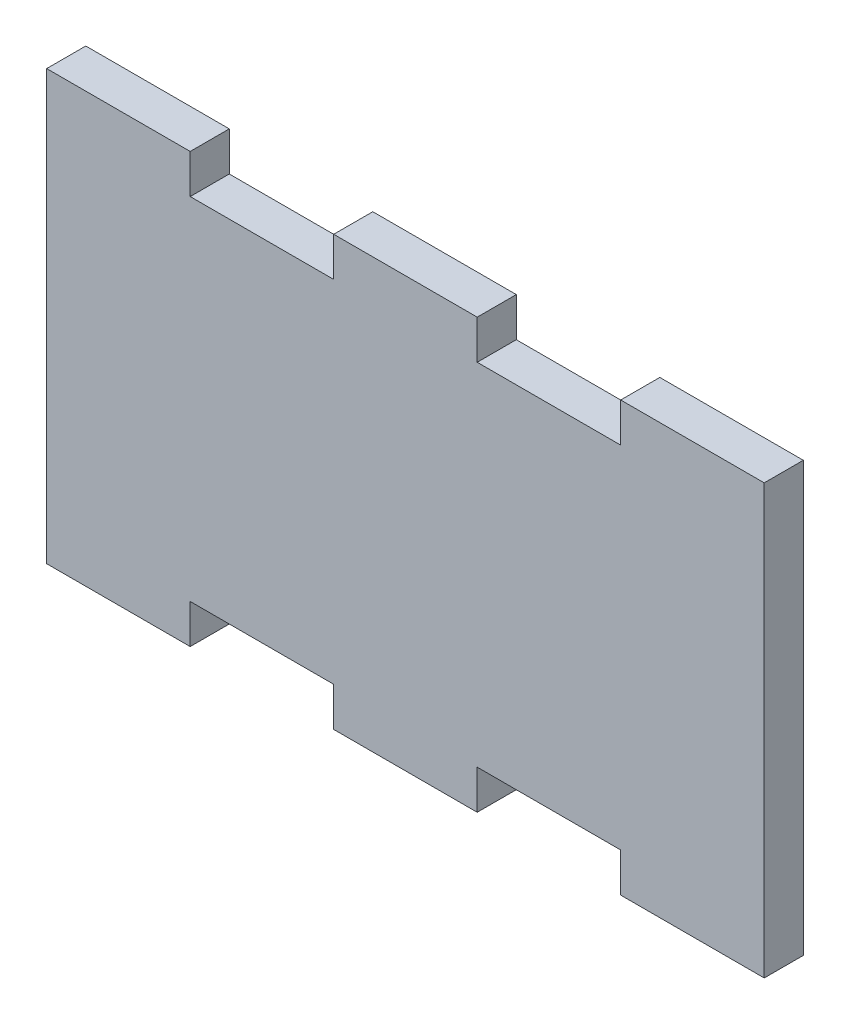
ISO-10303-21;
HEADER;
FILE_DESCRIPTION(('STEP AP214'),'2;1');
FILE_NAME('part.step','',(''),(''),'','','');
FILE_SCHEMA(('AUTOMOTIVE_DESIGN { 1 0 10303 214 1 1 1 1 }'));
ENDSEC;
DATA;
#1=APPLICATION_CONTEXT('core data for automotive mechanical design processes');
#2=APPLICATION_PROTOCOL_DEFINITION('international standard','automotive_design',2000,#1);
#3=PRODUCT_CONTEXT('',#1,'mechanical');
#4=PRODUCT('Part','Part','',(#3));
#5=PRODUCT_RELATED_PRODUCT_CATEGORY('part','',(#4));
#6=PRODUCT_DEFINITION_FORMATION('','',#4);
#7=PRODUCT_DEFINITION_CONTEXT('part definition',#1,'design');
#8=PRODUCT_DEFINITION('design','',#6,#7);
#9=PRODUCT_DEFINITION_SHAPE('','',#8);
#10=(LENGTH_UNIT() NAMED_UNIT(*) SI_UNIT(.MILLI.,.METRE.));
#11=(NAMED_UNIT(*) PLANE_ANGLE_UNIT() SI_UNIT($,.RADIAN.));
#12=(NAMED_UNIT(*) SI_UNIT($,.STERADIAN.) SOLID_ANGLE_UNIT());
#13=UNCERTAINTY_MEASURE_WITH_UNIT(LENGTH_MEASURE(1.E-05),#10,'distance_accuracy_value','');
#14=(GEOMETRIC_REPRESENTATION_CONTEXT(3) GLOBAL_UNCERTAINTY_ASSIGNED_CONTEXT((#13)) GLOBAL_UNIT_ASSIGNED_CONTEXT((#10,
#11,#12)) REPRESENTATION_CONTEXT('',''));
#15=CARTESIAN_POINT('',(0.,0.,0.));
#16=DIRECTION('',(0.,0.,1.));
#17=DIRECTION('',(1.,0.,0.));
#18=AXIS2_PLACEMENT_3D('',#15,#16,#17);
#19=CARTESIAN_POINT('',(29.14,17.415,3.175));
#20=DIRECTION('',(0.,-1.,0.));
#21=DIRECTION('',(0.,0.,-1.));
#22=AXIS2_PLACEMENT_3D('',#19,#20,#21);
#23=PLANE('',#22);
#24=DIRECTION('',(-1.,0.,0.));
#25=VECTOR('',#24,1.);
#26=CARTESIAN_POINT('',(29.14,17.415,0.));
#27=LINE('',#26,#25);
#28=CARTESIAN_POINT('',(34.968,17.415,0.));
#29=VERTEX_POINT('',#28);
#30=CARTESIAN_POINT('',(23.312,17.415,0.));
#31=VERTEX_POINT('',#30);
#32=EDGE_CURVE('E130',#29,#31,#27,.T.);
#33=ORIENTED_EDGE('',*,*,#32,.T.);
#34=DIRECTION('',(0.,0.,-1.));
#35=VECTOR('',#34,1.);
#36=CARTESIAN_POINT('',(23.312,17.415,3.175));
#37=LINE('',#36,#35);
#38=CARTESIAN_POINT('',(23.312,17.415,3.175));
#39=VERTEX_POINT('',#38);
#40=EDGE_CURVE('E11',#39,#31,#37,.T.);
#41=ORIENTED_EDGE('',*,*,#40,.F.);
#42=DIRECTION('',(-1.,0.,0.));
#43=VECTOR('',#42,1.);
#44=CARTESIAN_POINT('',(29.14,17.415,3.175));
#45=LINE('',#44,#43);
#46=CARTESIAN_POINT('',(34.968,17.415,3.175));
#47=VERTEX_POINT('',#46);
#48=EDGE_CURVE('E93',#47,#39,#45,.T.);
#49=ORIENTED_EDGE('',*,*,#48,.F.);
#50=DIRECTION('',(0.,0.,-1.));
#51=VECTOR('',#50,1.);
#52=CARTESIAN_POINT('',(34.968,17.415,3.175));
#53=LINE('',#52,#51);
#54=EDGE_CURVE('E239',#47,#29,#53,.T.);
#55=ORIENTED_EDGE('',*,*,#54,.T.);
#56=EDGE_LOOP('',(#33,#41,#49,#55));
#57=FACE_BOUND('',#56,.T.);
#58=ADVANCED_FACE('F39',(#57),#23,.F.);
#59=CARTESIAN_POINT('',(23.312,14.24,3.175));
#60=DIRECTION('',(1.,0.,0.));
#61=DIRECTION('',(0.,0.,-1.));
#62=AXIS2_PLACEMENT_3D('',#59,#60,#61);
#63=PLANE('',#62);
#64=DIRECTION('',(0.,-1.,0.));
#65=VECTOR('',#64,1.);
#66=CARTESIAN_POINT('',(23.312,14.24,0.));
#67=LINE('',#66,#65);
#68=CARTESIAN_POINT('',(23.312,14.24,0.));
#69=VERTEX_POINT('',#68);
#70=EDGE_CURVE('E133',#31,#69,#67,.T.);
#71=ORIENTED_EDGE('',*,*,#70,.T.);
#72=DIRECTION('',(0.,0.,-1.));
#73=VECTOR('',#72,1.);
#74=CARTESIAN_POINT('',(23.312,14.24,3.175));
#75=LINE('',#74,#73);
#76=CARTESIAN_POINT('',(23.312,14.24,3.175));
#77=VERTEX_POINT('',#76);
#78=EDGE_CURVE('E48',#77,#69,#75,.T.);
#79=ORIENTED_EDGE('',*,*,#78,.F.);
#80=DIRECTION('',(0.,-1.,0.));
#81=VECTOR('',#80,1.);
#82=CARTESIAN_POINT('',(23.312,14.24,3.175));
#83=LINE('',#82,#81);
#84=EDGE_CURVE('E107',#39,#77,#83,.T.);
#85=ORIENTED_EDGE('',*,*,#84,.F.);
#86=ORIENTED_EDGE('',*,*,#40,.T.);
#87=EDGE_LOOP('',(#71,#79,#85,#86));
#88=FACE_BOUND('',#87,.T.);
#89=ADVANCED_FACE('F459',(#88),#63,.F.);
#90=CARTESIAN_POINT('',(11.656,14.24,3.175));
#91=DIRECTION('',(0.,-1.,0.));
#92=DIRECTION('',(0.,0.,-1.));
#93=AXIS2_PLACEMENT_3D('',#90,#91,#92);
#94=PLANE('',#93);
#95=DIRECTION('',(-1.,0.,0.));
#96=VECTOR('',#95,1.);
#97=CARTESIAN_POINT('',(11.656,14.24,0.));
#98=LINE('',#97,#96);
#99=CARTESIAN_POINT('',(11.656,14.24,0.));
#100=VERTEX_POINT('',#99);
#101=EDGE_CURVE('E116',#69,#100,#98,.T.);
#102=ORIENTED_EDGE('',*,*,#101,.T.);
#103=DIRECTION('',(0.,0.,-1.));
#104=VECTOR('',#103,1.);
#105=CARTESIAN_POINT('',(11.656,14.24,3.175));
#106=LINE('',#105,#104);
#107=CARTESIAN_POINT('',(11.656,14.24,3.175));
#108=VERTEX_POINT('',#107);
#109=EDGE_CURVE('E113',#108,#100,#106,.T.);
#110=ORIENTED_EDGE('',*,*,#109,.F.);
#111=DIRECTION('',(-1.,0.,0.));
#112=VECTOR('',#111,1.);
#113=CARTESIAN_POINT('',(11.656,14.24,3.175));
#114=LINE('',#113,#112);
#115=EDGE_CURVE('E101',#77,#108,#114,.T.);
#116=ORIENTED_EDGE('',*,*,#115,.F.);
#117=ORIENTED_EDGE('',*,*,#78,.T.);
#118=EDGE_LOOP('',(#102,#110,#116,#117));
#119=FACE_BOUND('',#118,.T.);
#120=ADVANCED_FACE('F114',(#119),#94,.F.);
#121=CARTESIAN_POINT('',(11.656,14.24,3.175));
#122=DIRECTION('',(-1.,0.,0.));
#123=DIRECTION('',(0.,0.,1.));
#124=AXIS2_PLACEMENT_3D('',#121,#122,#123);
#125=PLANE('',#124);
#126=DIRECTION('',(0.,1.,0.));
#127=VECTOR('',#126,1.);
#128=CARTESIAN_POINT('',(11.656,14.24,0.));
#129=LINE('',#128,#127);
#130=CARTESIAN_POINT('',(11.656,17.415,0.));
#131=VERTEX_POINT('',#130);
#132=EDGE_CURVE('E78',#100,#131,#129,.T.);
#133=ORIENTED_EDGE('',*,*,#132,.T.);
#134=DIRECTION('',(0.,0.,-1.));
#135=VECTOR('',#134,1.);
#136=CARTESIAN_POINT('',(11.656,17.415,3.175));
#137=LINE('',#136,#135);
#138=CARTESIAN_POINT('',(11.656,17.415,3.175));
#139=VERTEX_POINT('',#138);
#140=EDGE_CURVE('E118',#139,#131,#137,.T.);
#141=ORIENTED_EDGE('',*,*,#140,.F.);
#142=DIRECTION('',(0.,1.,0.));
#143=VECTOR('',#142,1.);
#144=CARTESIAN_POINT('',(11.656,14.24,3.175));
#145=LINE('',#144,#143);
#146=EDGE_CURVE('E105',#108,#139,#145,.T.);
#147=ORIENTED_EDGE('',*,*,#146,.F.);
#148=ORIENTED_EDGE('',*,*,#109,.T.);
#149=EDGE_LOOP('',(#133,#141,#147,#148));
#150=FACE_BOUND('',#149,.T.);
#151=ADVANCED_FACE('F120',(#150),#125,.F.);
#152=CARTESIAN_POINT('',(0.,17.415,3.175));
#153=DIRECTION('',(0.,-1.,0.));
#154=DIRECTION('',(0.,0.,-1.));
#155=AXIS2_PLACEMENT_3D('',#152,#153,#154);
#156=PLANE('',#155);
#157=DIRECTION('',(-1.,0.,0.));
#158=VECTOR('',#157,1.);
#159=CARTESIAN_POINT('',(0.,17.415,0.));
#160=LINE('',#159,#158);
#161=CARTESIAN_POINT('',(0.,17.415,0.));
#162=VERTEX_POINT('',#161);
#163=EDGE_CURVE('E85',#131,#162,#160,.T.);
#164=ORIENTED_EDGE('',*,*,#163,.T.);
#165=DIRECTION('',(0.,0.,-1.));
#166=VECTOR('',#165,1.);
#167=CARTESIAN_POINT('',(0.,17.415,3.175));
#168=LINE('',#167,#166);
#169=CARTESIAN_POINT('',(0.,17.415,3.175));
#170=VERTEX_POINT('',#169);
#171=EDGE_CURVE('E126',#170,#162,#168,.T.);
#172=ORIENTED_EDGE('',*,*,#171,.F.);
#173=DIRECTION('',(-1.,0.,0.));
#174=VECTOR('',#173,1.);
#175=CARTESIAN_POINT('',(0.,17.415,3.175));
#176=LINE('',#175,#174);
#177=EDGE_CURVE('E123',#139,#170,#176,.T.);
#178=ORIENTED_EDGE('',*,*,#177,.F.);
#179=ORIENTED_EDGE('',*,*,#140,.T.);
#180=EDGE_LOOP('',(#164,#172,#178,#179));
#181=FACE_BOUND('',#180,.T.);
#182=ADVANCED_FACE('F469',(#181),#156,.F.);
#183=CARTESIAN_POINT('',(0.,14.24,3.175));
#184=DIRECTION('',(1.,0.,0.));
#185=DIRECTION('',(0.,0.,-1.));
#186=AXIS2_PLACEMENT_3D('',#183,#184,#185);
#187=PLANE('',#186);
#188=DIRECTION('',(0.,-1.,0.));
#189=VECTOR('',#188,1.);
#190=CARTESIAN_POINT('',(0.,14.24,0.));
#191=LINE('',#190,#189);
#192=CARTESIAN_POINT('',(0.,-17.415,0.));
#193=VERTEX_POINT('',#192);
#194=EDGE_CURVE('E143',#162,#193,#191,.T.);
#195=ORIENTED_EDGE('',*,*,#194,.T.);
#196=DIRECTION('',(0.,0.,-1.));
#197=VECTOR('',#196,1.);
#198=CARTESIAN_POINT('',(0.,-17.415,3.175));
#199=LINE('',#198,#197);
#200=CARTESIAN_POINT('',(0.,-17.415,3.175));
#201=VERTEX_POINT('',#200);
#202=EDGE_CURVE('E163',#201,#193,#199,.T.);
#203=ORIENTED_EDGE('',*,*,#202,.F.);
#204=DIRECTION('',(0.,-1.,0.));
#205=VECTOR('',#204,1.);
#206=CARTESIAN_POINT('',(0.,0.,3.175));
#207=LINE('',#206,#205);
#208=EDGE_CURVE('E56',#170,#201,#207,.T.);
#209=ORIENTED_EDGE('',*,*,#208,.F.);
#210=ORIENTED_EDGE('',*,*,#171,.T.);
#211=EDGE_LOOP('',(#195,#203,#209,#210));
#212=FACE_BOUND('',#211,.T.);
#213=ADVANCED_FACE('F162',(#212),#187,.F.);
#214=CARTESIAN_POINT('',(0.,0.,3.175));
#215=DIRECTION('',(0.,0.,-1.));
#216=DIRECTION('',(-1.,0.,0.));
#217=AXIS2_PLACEMENT_3D('',#214,#215,#216);
#218=PLANE('',#217);
#219=ORIENTED_EDGE('',*,*,#208,.T.);
#220=DIRECTION('',(-1.,0.,0.));
#221=VECTOR('',#220,1.);
#222=CARTESIAN_POINT('',(0.,-17.415,3.175));
#223=LINE('',#222,#221);
#224=CARTESIAN_POINT('',(11.656,-17.415,3.175));
#225=VERTEX_POINT('',#224);
#226=EDGE_CURVE('E172',#225,#201,#223,.T.);
#227=ORIENTED_EDGE('',*,*,#226,.F.);
#228=DIRECTION('',(0.,-1.,0.));
#229=VECTOR('',#228,1.);
#230=CARTESIAN_POINT('',(11.656,-14.24,3.175));
#231=LINE('',#230,#229);
#232=CARTESIAN_POINT('',(11.656,-14.24,3.175));
#233=VERTEX_POINT('',#232);
#234=EDGE_CURVE('E180',#233,#225,#231,.T.);
#235=ORIENTED_EDGE('',*,*,#234,.F.);
#236=DIRECTION('',(-1.,0.,0.));
#237=VECTOR('',#236,1.);
#238=CARTESIAN_POINT('',(11.656,-14.24,3.175));
#239=LINE('',#238,#237);
#240=CARTESIAN_POINT('',(23.312,-14.24,3.175));
#241=VERTEX_POINT('',#240);
#242=EDGE_CURVE('E228',#241,#233,#239,.T.);
#243=ORIENTED_EDGE('',*,*,#242,.F.);
#244=DIRECTION('',(0.,1.,0.));
#245=VECTOR('',#244,1.);
#246=CARTESIAN_POINT('',(23.312,-14.24,3.175));
#247=LINE('',#246,#245);
#248=CARTESIAN_POINT('',(23.312,-17.415,3.175));
#249=VERTEX_POINT('',#248);
#250=EDGE_CURVE('E245',#249,#241,#247,.T.);
#251=ORIENTED_EDGE('',*,*,#250,.F.);
#252=DIRECTION('',(-1.,0.,0.));
#253=VECTOR('',#252,1.);
#254=CARTESIAN_POINT('',(29.14,-17.415,3.175));
#255=LINE('',#254,#253);
#256=CARTESIAN_POINT('',(34.968,-17.415,3.175));
#257=VERTEX_POINT('',#256);
#258=EDGE_CURVE('E249',#257,#249,#255,.T.);
#259=ORIENTED_EDGE('',*,*,#258,.F.);
#260=DIRECTION('',(0.,1.,0.));
#261=VECTOR('',#260,1.);
#262=CARTESIAN_POINT('',(34.968,-14.24,3.175));
#263=LINE('',#262,#261);
#264=CARTESIAN_POINT('',(34.968,-14.24,3.175));
#265=VERTEX_POINT('',#264);
#266=EDGE_CURVE('E337',#257,#265,#263,.T.);
#267=ORIENTED_EDGE('',*,*,#266,.T.);
#268=DIRECTION('',(1.,0.,0.));
#269=VECTOR('',#268,1.);
#270=CARTESIAN_POINT('',(46.624,-14.24,3.175));
#271=LINE('',#270,#269);
#272=CARTESIAN_POINT('',(46.624,-14.24,3.175));
#273=VERTEX_POINT('',#272);
#274=EDGE_CURVE('E357',#265,#273,#271,.T.);
#275=ORIENTED_EDGE('',*,*,#274,.T.);
#276=DIRECTION('',(0.,-1.,0.));
#277=VECTOR('',#276,1.);
#278=CARTESIAN_POINT('',(46.624,-14.24,3.175));
#279=LINE('',#278,#277);
#280=CARTESIAN_POINT('',(46.624,-17.415,3.175));
#281=VERTEX_POINT('',#280);
#282=EDGE_CURVE('E353',#273,#281,#279,.T.);
#283=ORIENTED_EDGE('',*,*,#282,.T.);
#284=DIRECTION('',(1.,0.,0.));
#285=VECTOR('',#284,1.);
#286=CARTESIAN_POINT('',(58.28,-17.415,3.175));
#287=LINE('',#286,#285);
#288=CARTESIAN_POINT('',(58.28,-17.415,3.175));
#289=VERTEX_POINT('',#288);
#290=EDGE_CURVE('E332',#281,#289,#287,.T.);
#291=ORIENTED_EDGE('',*,*,#290,.T.);
#292=DIRECTION('',(0.,-1.,0.));
#293=VECTOR('',#292,1.);
#294=CARTESIAN_POINT('',(58.28,0.,3.175));
#295=LINE('',#294,#293);
#296=CARTESIAN_POINT('',(58.28,17.415,3.175));
#297=VERTEX_POINT('',#296);
#298=EDGE_CURVE('E277',#297,#289,#295,.T.);
#299=ORIENTED_EDGE('',*,*,#298,.F.);
#300=DIRECTION('',(1.,0.,0.));
#301=VECTOR('',#300,1.);
#302=CARTESIAN_POINT('',(58.28,17.415,3.175));
#303=LINE('',#302,#301);
#304=CARTESIAN_POINT('',(46.624,17.415,3.175));
#305=VERTEX_POINT('',#304);
#306=EDGE_CURVE('E272',#305,#297,#303,.T.);
#307=ORIENTED_EDGE('',*,*,#306,.F.);
#308=DIRECTION('',(0.,1.,0.));
#309=VECTOR('',#308,1.);
#310=CARTESIAN_POINT('',(46.624,14.24,3.175));
#311=LINE('',#310,#309);
#312=CARTESIAN_POINT('',(46.624,14.24,3.175));
#313=VERTEX_POINT('',#312);
#314=EDGE_CURVE('E298',#313,#305,#311,.T.);
#315=ORIENTED_EDGE('',*,*,#314,.F.);
#316=DIRECTION('',(1.,0.,0.));
#317=VECTOR('',#316,1.);
#318=CARTESIAN_POINT('',(46.624,14.24,3.175));
#319=LINE('',#318,#317);
#320=CARTESIAN_POINT('',(34.968,14.24,3.175));
#321=VERTEX_POINT('',#320);
#322=EDGE_CURVE('E302',#321,#313,#319,.T.);
#323=ORIENTED_EDGE('',*,*,#322,.F.);
#324=DIRECTION('',(0.,-1.,0.));
#325=VECTOR('',#324,1.);
#326=CARTESIAN_POINT('',(34.968,14.24,3.175));
#327=LINE('',#326,#325);
#328=EDGE_CURVE('E306',#47,#321,#327,.T.);
#329=ORIENTED_EDGE('',*,*,#328,.F.);
#330=ORIENTED_EDGE('',*,*,#48,.T.);
#331=ORIENTED_EDGE('',*,*,#84,.T.);
#332=ORIENTED_EDGE('',*,*,#115,.T.);
#333=ORIENTED_EDGE('',*,*,#146,.T.);
#334=ORIENTED_EDGE('',*,*,#177,.T.);
#335=EDGE_LOOP('',(#219,#227,#235,#243,#251,#259,#267,#275,#283,#291,#299,#307,#315,#323,#329,
#330,#331,#332,#333,#334));
#336=FACE_BOUND('',#335,.T.);
#337=ADVANCED_FACE('F103',(#336),#218,.F.);
#338=CARTESIAN_POINT('',(0.,0.,0.));
#339=DIRECTION('',(0.,0.,-1.));
#340=DIRECTION('',(-1.,0.,0.));
#341=AXIS2_PLACEMENT_3D('',#338,#339,#340);
#342=PLANE('',#341);
#343=ORIENTED_EDGE('',*,*,#32,.F.);
#344=DIRECTION('',(0.,-1.,0.));
#345=VECTOR('',#344,1.);
#346=CARTESIAN_POINT('',(34.968,14.24,0.));
#347=LINE('',#346,#345);
#348=CARTESIAN_POINT('',(34.968,14.24,0.));
#349=VERTEX_POINT('',#348);
#350=EDGE_CURVE('E290',#29,#349,#347,.T.);
#351=ORIENTED_EDGE('',*,*,#350,.T.);
#352=DIRECTION('',(1.,0.,0.));
#353=VECTOR('',#352,1.);
#354=CARTESIAN_POINT('',(46.624,14.24,0.));
#355=LINE('',#354,#353);
#356=CARTESIAN_POINT('',(46.624,14.24,0.));
#357=VERTEX_POINT('',#356);
#358=EDGE_CURVE('E286',#349,#357,#355,.T.);
#359=ORIENTED_EDGE('',*,*,#358,.T.);
#360=DIRECTION('',(0.,1.,0.));
#361=VECTOR('',#360,1.);
#362=CARTESIAN_POINT('',(46.624,14.24,0.));
#363=LINE('',#362,#361);
#364=CARTESIAN_POINT('',(46.624,17.415,0.));
#365=VERTEX_POINT('',#364);
#366=EDGE_CURVE('E282',#357,#365,#363,.T.);
#367=ORIENTED_EDGE('',*,*,#366,.T.);
#368=DIRECTION('',(1.,0.,0.));
#369=VECTOR('',#368,1.);
#370=CARTESIAN_POINT('',(58.28,17.415,0.));
#371=LINE('',#370,#369);
#372=CARTESIAN_POINT('',(58.28,17.415,0.));
#373=VERTEX_POINT('',#372);
#374=EDGE_CURVE('E278',#365,#373,#371,.T.);
#375=ORIENTED_EDGE('',*,*,#374,.T.);
#376=DIRECTION('',(0.,-1.,0.));
#377=VECTOR('',#376,1.);
#378=CARTESIAN_POINT('',(58.28,14.24,0.));
#379=LINE('',#378,#377);
#380=CARTESIAN_POINT('',(58.28,-17.415,0.));
#381=VERTEX_POINT('',#380);
#382=EDGE_CURVE('E273',#373,#381,#379,.T.);
#383=ORIENTED_EDGE('',*,*,#382,.T.);
#384=DIRECTION('',(1.,0.,0.));
#385=VECTOR('',#384,1.);
#386=CARTESIAN_POINT('',(58.28,-17.415,0.));
#387=LINE('',#386,#385);
#388=CARTESIAN_POINT('',(46.624,-17.415,0.));
#389=VERTEX_POINT('',#388);
#390=EDGE_CURVE('E333',#389,#381,#387,.T.);
#391=ORIENTED_EDGE('',*,*,#390,.F.);
#392=DIRECTION('',(0.,-1.,0.));
#393=VECTOR('',#392,1.);
#394=CARTESIAN_POINT('',(46.624,-14.24,0.));
#395=LINE('',#394,#393);
#396=CARTESIAN_POINT('',(46.624,-14.24,0.));
#397=VERTEX_POINT('',#396);
#398=EDGE_CURVE('E338',#397,#389,#395,.T.);
#399=ORIENTED_EDGE('',*,*,#398,.F.);
#400=DIRECTION('',(1.,0.,0.));
#401=VECTOR('',#400,1.);
#402=CARTESIAN_POINT('',(46.624,-14.24,0.));
#403=LINE('',#402,#401);
#404=CARTESIAN_POINT('',(34.968,-14.24,0.));
#405=VERTEX_POINT('',#404);
#406=EDGE_CURVE('E342',#405,#397,#403,.T.);
#407=ORIENTED_EDGE('',*,*,#406,.F.);
#408=DIRECTION('',(0.,1.,0.));
#409=VECTOR('',#408,1.);
#410=CARTESIAN_POINT('',(34.968,-14.24,0.));
#411=LINE('',#410,#409);
#412=CARTESIAN_POINT('',(34.968,-17.415,0.));
#413=VERTEX_POINT('',#412);
#414=EDGE_CURVE('E346',#413,#405,#411,.T.);
#415=ORIENTED_EDGE('',*,*,#414,.F.);
#416=DIRECTION('',(-1.,0.,0.));
#417=VECTOR('',#416,1.);
#418=CARTESIAN_POINT('',(29.14,-17.415,0.));
#419=LINE('',#418,#417);
#420=CARTESIAN_POINT('',(23.312,-17.415,0.));
#421=VERTEX_POINT('',#420);
#422=EDGE_CURVE('E235',#413,#421,#419,.T.);
#423=ORIENTED_EDGE('',*,*,#422,.T.);
#424=DIRECTION('',(0.,1.,0.));
#425=VECTOR('',#424,1.);
#426=CARTESIAN_POINT('',(23.312,-14.24,0.));
#427=LINE('',#426,#425);
#428=CARTESIAN_POINT('',(23.312,-14.24,0.));
#429=VERTEX_POINT('',#428);
#430=EDGE_CURVE('E231',#421,#429,#427,.T.);
#431=ORIENTED_EDGE('',*,*,#430,.T.);
#432=DIRECTION('',(-1.,0.,0.));
#433=VECTOR('',#432,1.);
#434=CARTESIAN_POINT('',(11.656,-14.24,0.));
#435=LINE('',#434,#433);
#436=CARTESIAN_POINT('',(11.656,-14.24,0.));
#437=VERTEX_POINT('',#436);
#438=EDGE_CURVE('E223',#429,#437,#435,.T.);
#439=ORIENTED_EDGE('',*,*,#438,.T.);
#440=DIRECTION('',(0.,-1.,0.));
#441=VECTOR('',#440,1.);
#442=CARTESIAN_POINT('',(11.656,-14.24,0.));
#443=LINE('',#442,#441);
#444=CARTESIAN_POINT('',(11.656,-17.415,0.));
#445=VERTEX_POINT('',#444);
#446=EDGE_CURVE('E217',#437,#445,#443,.T.);
#447=ORIENTED_EDGE('',*,*,#446,.T.);
#448=DIRECTION('',(-1.,0.,0.));
#449=VECTOR('',#448,1.);
#450=CARTESIAN_POINT('',(0.,-17.415,0.));
#451=LINE('',#450,#449);
#452=EDGE_CURVE('E160',#445,#193,#451,.T.);
#453=ORIENTED_EDGE('',*,*,#452,.T.);
#454=ORIENTED_EDGE('',*,*,#194,.F.);
#455=ORIENTED_EDGE('',*,*,#163,.F.);
#456=ORIENTED_EDGE('',*,*,#132,.F.);
#457=ORIENTED_EDGE('',*,*,#101,.F.);
#458=ORIENTED_EDGE('',*,*,#70,.F.);
#459=EDGE_LOOP('',(#343,#351,#359,#367,#375,#383,#391,#399,#407,#415,#423,#431,#439,#447,#453,
#454,#455,#456,#457,#458));
#460=FACE_BOUND('',#459,.T.);
#461=ADVANCED_FACE('F155',(#460),#342,.T.);
#462=CARTESIAN_POINT('',(29.14,-17.415,3.175));
#463=DIRECTION('',(0.,1.,0.));
#464=DIRECTION('',(0.,0.,-1.));
#465=AXIS2_PLACEMENT_3D('',#462,#463,#464);
#466=PLANE('',#465);
#467=ORIENTED_EDGE('',*,*,#422,.F.);
#468=DIRECTION('',(0.,0.,-1.));
#469=VECTOR('',#468,1.);
#470=CARTESIAN_POINT('',(34.968,-17.415,3.175));
#471=LINE('',#470,#469);
#472=EDGE_CURVE('E294',#257,#413,#471,.T.);
#473=ORIENTED_EDGE('',*,*,#472,.F.);
#474=ORIENTED_EDGE('',*,*,#258,.T.);
#475=DIRECTION('',(0.,0.,-1.));
#476=VECTOR('',#475,1.);
#477=CARTESIAN_POINT('',(23.312,-17.415,3.175));
#478=LINE('',#477,#476);
#479=EDGE_CURVE('E134',#249,#421,#478,.T.);
#480=ORIENTED_EDGE('',*,*,#479,.T.);
#481=EDGE_LOOP('',(#467,#473,#474,#480));
#482=FACE_BOUND('',#481,.T.);
#483=ADVANCED_FACE('F429',(#482),#466,.F.);
#484=CARTESIAN_POINT('',(23.312,-14.24,3.175));
#485=DIRECTION('',(1.,0.,0.));
#486=DIRECTION('',(0.,0.,-1.));
#487=AXIS2_PLACEMENT_3D('',#484,#485,#486);
#488=PLANE('',#487);
#489=ORIENTED_EDGE('',*,*,#430,.F.);
#490=ORIENTED_EDGE('',*,*,#479,.F.);
#491=ORIENTED_EDGE('',*,*,#250,.T.);
#492=DIRECTION('',(0.,0.,-1.));
#493=VECTOR('',#492,1.);
#494=CARTESIAN_POINT('',(23.312,-14.24,3.175));
#495=LINE('',#494,#493);
#496=EDGE_CURVE('E188',#241,#429,#495,.T.);
#497=ORIENTED_EDGE('',*,*,#496,.T.);
#498=EDGE_LOOP('',(#489,#490,#491,#497));
#499=FACE_BOUND('',#498,.T.);
#500=ADVANCED_FACE('F427',(#499),#488,.F.);
#501=CARTESIAN_POINT('',(11.656,-14.24,3.175));
#502=DIRECTION('',(0.,1.,0.));
#503=DIRECTION('',(0.,0.,-1.));
#504=AXIS2_PLACEMENT_3D('',#501,#502,#503);
#505=PLANE('',#504);
#506=ORIENTED_EDGE('',*,*,#438,.F.);
#507=ORIENTED_EDGE('',*,*,#496,.F.);
#508=ORIENTED_EDGE('',*,*,#242,.T.);
#509=DIRECTION('',(0.,0.,-1.));
#510=VECTOR('',#509,1.);
#511=CARTESIAN_POINT('',(11.656,-14.24,3.175));
#512=LINE('',#511,#510);
#513=EDGE_CURVE('E178',#233,#437,#512,.T.);
#514=ORIENTED_EDGE('',*,*,#513,.T.);
#515=EDGE_LOOP('',(#506,#507,#508,#514));
#516=FACE_BOUND('',#515,.T.);
#517=ADVANCED_FACE('F225',(#516),#505,.F.);
#518=CARTESIAN_POINT('',(11.656,-14.24,3.175));
#519=DIRECTION('',(-1.,0.,0.));
#520=DIRECTION('',(0.,0.,1.));
#521=AXIS2_PLACEMENT_3D('',#518,#519,#520);
#522=PLANE('',#521);
#523=ORIENTED_EDGE('',*,*,#446,.F.);
#524=ORIENTED_EDGE('',*,*,#513,.F.);
#525=ORIENTED_EDGE('',*,*,#234,.T.);
#526=DIRECTION('',(0.,0.,-1.));
#527=VECTOR('',#526,1.);
#528=CARTESIAN_POINT('',(11.656,-17.415,3.175));
#529=LINE('',#528,#527);
#530=EDGE_CURVE('E174',#225,#445,#529,.T.);
#531=ORIENTED_EDGE('',*,*,#530,.T.);
#532=EDGE_LOOP('',(#523,#524,#525,#531));
#533=FACE_BOUND('',#532,.T.);
#534=ADVANCED_FACE('F218',(#533),#522,.F.);
#535=CARTESIAN_POINT('',(0.,-17.415,3.175));
#536=DIRECTION('',(0.,1.,0.));
#537=DIRECTION('',(0.,0.,-1.));
#538=AXIS2_PLACEMENT_3D('',#535,#536,#537);
#539=PLANE('',#538);
#540=ORIENTED_EDGE('',*,*,#452,.F.);
#541=ORIENTED_EDGE('',*,*,#530,.F.);
#542=ORIENTED_EDGE('',*,*,#226,.T.);
#543=ORIENTED_EDGE('',*,*,#202,.T.);
#544=EDGE_LOOP('',(#540,#541,#542,#543));
#545=FACE_BOUND('',#544,.T.);
#546=ADVANCED_FACE('F168',(#545),#539,.F.);
#547=CARTESIAN_POINT('',(34.968,14.24,3.175));
#548=DIRECTION('',(-1.,0.,0.));
#549=DIRECTION('',(0.,0.,-1.));
#550=AXIS2_PLACEMENT_3D('',#547,#548,#549);
#551=PLANE('',#550);
#552=ORIENTED_EDGE('',*,*,#350,.F.);
#553=ORIENTED_EDGE('',*,*,#54,.F.);
#554=ORIENTED_EDGE('',*,*,#328,.T.);
#555=DIRECTION('',(0.,0.,-1.));
#556=VECTOR('',#555,1.);
#557=CARTESIAN_POINT('',(34.968,14.24,3.175));
#558=LINE('',#557,#556);
#559=EDGE_CURVE('E256',#321,#349,#558,.T.);
#560=ORIENTED_EDGE('',*,*,#559,.T.);
#561=EDGE_LOOP('',(#552,#553,#554,#560));
#562=FACE_BOUND('',#561,.T.);
#563=ADVANCED_FACE('F457',(#562),#551,.F.);
#564=CARTESIAN_POINT('',(46.624,14.24,3.175));
#565=DIRECTION('',(0.,-1.,0.));
#566=DIRECTION('',(0.,0.,-1.));
#567=AXIS2_PLACEMENT_3D('',#564,#565,#566);
#568=PLANE('',#567);
#569=ORIENTED_EDGE('',*,*,#358,.F.);
#570=ORIENTED_EDGE('',*,*,#559,.F.);
#571=ORIENTED_EDGE('',*,*,#322,.T.);
#572=DIRECTION('',(0.,0.,-1.));
#573=VECTOR('',#572,1.);
#574=CARTESIAN_POINT('',(46.624,14.24,3.175));
#575=LINE('',#574,#573);
#576=EDGE_CURVE('E260',#313,#357,#575,.T.);
#577=ORIENTED_EDGE('',*,*,#576,.T.);
#578=EDGE_LOOP('',(#569,#570,#571,#577));
#579=FACE_BOUND('',#578,.T.);
#580=ADVANCED_FACE('F453',(#579),#568,.F.);
#581=CARTESIAN_POINT('',(46.624,14.24,3.175));
#582=DIRECTION('',(1.,0.,0.));
#583=DIRECTION('',(0.,0.,1.));
#584=AXIS2_PLACEMENT_3D('',#581,#582,#583);
#585=PLANE('',#584);
#586=ORIENTED_EDGE('',*,*,#366,.F.);
#587=ORIENTED_EDGE('',*,*,#576,.F.);
#588=ORIENTED_EDGE('',*,*,#314,.T.);
#589=DIRECTION('',(0.,0.,-1.));
#590=VECTOR('',#589,1.);
#591=CARTESIAN_POINT('',(46.624,17.415,3.175));
#592=LINE('',#591,#590);
#593=EDGE_CURVE('E264',#305,#365,#592,.T.);
#594=ORIENTED_EDGE('',*,*,#593,.T.);
#595=EDGE_LOOP('',(#586,#587,#588,#594));
#596=FACE_BOUND('',#595,.T.);
#597=ADVANCED_FACE('F451',(#596),#585,.F.);
#598=CARTESIAN_POINT('',(58.28,17.415,3.175));
#599=DIRECTION('',(0.,-1.,0.));
#600=DIRECTION('',(0.,0.,-1.));
#601=AXIS2_PLACEMENT_3D('',#598,#599,#600);
#602=PLANE('',#601);
#603=ORIENTED_EDGE('',*,*,#374,.F.);
#604=ORIENTED_EDGE('',*,*,#593,.F.);
#605=ORIENTED_EDGE('',*,*,#306,.T.);
#606=DIRECTION('',(0.,0.,-1.));
#607=VECTOR('',#606,1.);
#608=CARTESIAN_POINT('',(58.28,17.415,3.175));
#609=LINE('',#608,#607);
#610=EDGE_CURVE('E268',#297,#373,#609,.T.);
#611=ORIENTED_EDGE('',*,*,#610,.T.);
#612=EDGE_LOOP('',(#603,#604,#605,#611));
#613=FACE_BOUND('',#612,.T.);
#614=ADVANCED_FACE('F447',(#613),#602,.F.);
#615=CARTESIAN_POINT('',(58.28,14.24,3.175));
#616=DIRECTION('',(-1.,0.,0.));
#617=DIRECTION('',(0.,0.,-1.));
#618=AXIS2_PLACEMENT_3D('',#615,#616,#617);
#619=PLANE('',#618);
#620=ORIENTED_EDGE('',*,*,#382,.F.);
#621=ORIENTED_EDGE('',*,*,#610,.F.);
#622=ORIENTED_EDGE('',*,*,#298,.T.);
#623=DIRECTION('',(0.,0.,-1.));
#624=VECTOR('',#623,1.);
#625=CARTESIAN_POINT('',(58.28,-17.415,3.175));
#626=LINE('',#625,#624);
#627=EDGE_CURVE('E328',#289,#381,#626,.T.);
#628=ORIENTED_EDGE('',*,*,#627,.T.);
#629=EDGE_LOOP('',(#620,#621,#622,#628));
#630=FACE_BOUND('',#629,.T.);
#631=ADVANCED_FACE('F444',(#630),#619,.F.);
#632=CARTESIAN_POINT('',(34.968,-14.24,3.175));
#633=DIRECTION('',(-1.,0.,0.));
#634=DIRECTION('',(0.,0.,-1.));
#635=AXIS2_PLACEMENT_3D('',#632,#633,#634);
#636=PLANE('',#635);
#637=ORIENTED_EDGE('',*,*,#414,.T.);
#638=DIRECTION('',(0.,0.,-1.));
#639=VECTOR('',#638,1.);
#640=CARTESIAN_POINT('',(34.968,-14.24,3.175));
#641=LINE('',#640,#639);
#642=EDGE_CURVE('E316',#265,#405,#641,.T.);
#643=ORIENTED_EDGE('',*,*,#642,.F.);
#644=ORIENTED_EDGE('',*,*,#266,.F.);
#645=ORIENTED_EDGE('',*,*,#472,.T.);
#646=EDGE_LOOP('',(#637,#643,#644,#645));
#647=FACE_BOUND('',#646,.T.);
#648=ADVANCED_FACE('F374',(#647),#636,.F.);
#649=CARTESIAN_POINT('',(46.624,-14.24,3.175));
#650=DIRECTION('',(0.,1.,0.));
#651=DIRECTION('',(0.,0.,-1.));
#652=AXIS2_PLACEMENT_3D('',#649,#650,#651);
#653=PLANE('',#652);
#654=ORIENTED_EDGE('',*,*,#406,.T.);
#655=DIRECTION('',(0.,0.,-1.));
#656=VECTOR('',#655,1.);
#657=CARTESIAN_POINT('',(46.624,-14.24,3.175));
#658=LINE('',#657,#656);
#659=EDGE_CURVE('E320',#273,#397,#658,.T.);
#660=ORIENTED_EDGE('',*,*,#659,.F.);
#661=ORIENTED_EDGE('',*,*,#274,.F.);
#662=ORIENTED_EDGE('',*,*,#642,.T.);
#663=EDGE_LOOP('',(#654,#660,#661,#662));
#664=FACE_BOUND('',#663,.T.);
#665=ADVANCED_FACE('F434',(#664),#653,.F.);
#666=CARTESIAN_POINT('',(46.624,-14.24,3.175));
#667=DIRECTION('',(1.,0.,0.));
#668=DIRECTION('',(0.,0.,1.));
#669=AXIS2_PLACEMENT_3D('',#666,#667,#668);
#670=PLANE('',#669);
#671=ORIENTED_EDGE('',*,*,#398,.T.);
#672=DIRECTION('',(0.,0.,-1.));
#673=VECTOR('',#672,1.);
#674=CARTESIAN_POINT('',(46.624,-17.415,3.175));
#675=LINE('',#674,#673);
#676=EDGE_CURVE('E324',#281,#389,#675,.T.);
#677=ORIENTED_EDGE('',*,*,#676,.F.);
#678=ORIENTED_EDGE('',*,*,#282,.F.);
#679=ORIENTED_EDGE('',*,*,#659,.T.);
#680=EDGE_LOOP('',(#671,#677,#678,#679));
#681=FACE_BOUND('',#680,.T.);
#682=ADVANCED_FACE('F437',(#681),#670,.F.);
#683=CARTESIAN_POINT('',(58.28,-17.415,3.175));
#684=DIRECTION('',(0.,1.,0.));
#685=DIRECTION('',(0.,0.,-1.));
#686=AXIS2_PLACEMENT_3D('',#683,#684,#685);
#687=PLANE('',#686);
#688=ORIENTED_EDGE('',*,*,#390,.T.);
#689=ORIENTED_EDGE('',*,*,#627,.F.);
#690=ORIENTED_EDGE('',*,*,#290,.F.);
#691=ORIENTED_EDGE('',*,*,#676,.T.);
#692=EDGE_LOOP('',(#688,#689,#690,#691));
#693=FACE_BOUND('',#692,.T.);
#694=ADVANCED_FACE('F442',(#693),#687,.F.);
#695=CLOSED_SHELL('',(#58,#89,#120,#151,#182,#213,#337,#461,#483,#500,#517,#534,#546,#563,#580,
#597,#614,#631,#648,#665,#682,#694));
#696=MANIFOLD_SOLID_BREP('B2',#695);
#697=ADVANCED_BREP_SHAPE_REPRESENTATION('',(#18,#696),#14);
#698=SHAPE_DEFINITION_REPRESENTATION(#9,#697);
ENDSEC;
END-ISO-10303-21;
